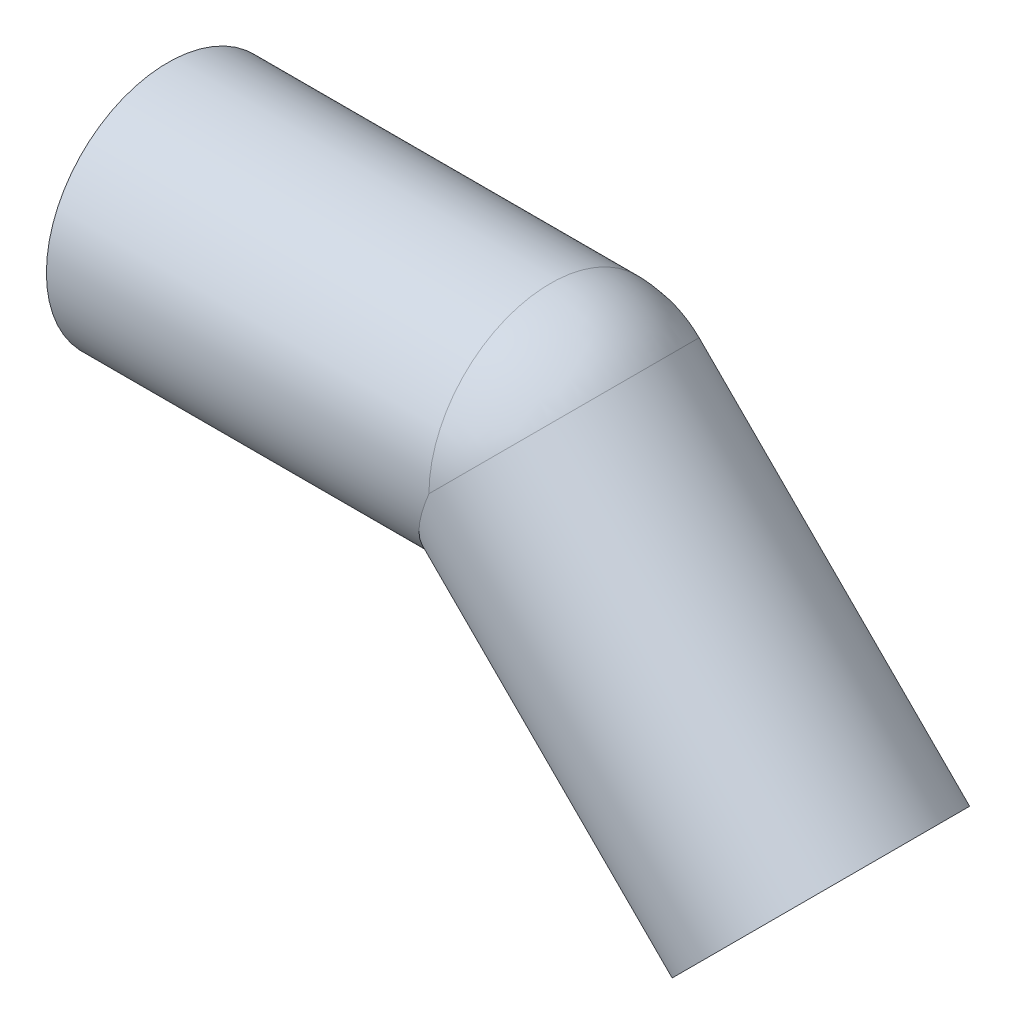
ISO-10303-21;
HEADER;
FILE_DESCRIPTION(('STEP AP214'),'2;1');
FILE_NAME('part.step','',(''),(''),'','','');
FILE_SCHEMA(('AUTOMOTIVE_DESIGN { 1 0 10303 214 1 1 1 1 }'));
ENDSEC;
DATA;
#1=APPLICATION_CONTEXT('core data for automotive mechanical design processes');
#2=APPLICATION_PROTOCOL_DEFINITION('international standard','automotive_design',2000,#1);
#3=PRODUCT_CONTEXT('',#1,'mechanical');
#4=PRODUCT('Part','Part','',(#3));
#5=PRODUCT_RELATED_PRODUCT_CATEGORY('part','',(#4));
#6=PRODUCT_DEFINITION_FORMATION('','',#4);
#7=PRODUCT_DEFINITION_CONTEXT('part definition',#1,'design');
#8=PRODUCT_DEFINITION('design','',#6,#7);
#9=PRODUCT_DEFINITION_SHAPE('','',#8);
#10=(LENGTH_UNIT() NAMED_UNIT(*) SI_UNIT(.MILLI.,.METRE.));
#11=(NAMED_UNIT(*) PLANE_ANGLE_UNIT() SI_UNIT($,.RADIAN.));
#12=(NAMED_UNIT(*) SI_UNIT($,.STERADIAN.) SOLID_ANGLE_UNIT());
#13=UNCERTAINTY_MEASURE_WITH_UNIT(LENGTH_MEASURE(1.E-05),#10,'distance_accuracy_value','');
#14=(GEOMETRIC_REPRESENTATION_CONTEXT(3) GLOBAL_UNCERTAINTY_ASSIGNED_CONTEXT((#13)) GLOBAL_UNIT_ASSIGNED_CONTEXT((#10,
#11,#12)) REPRESENTATION_CONTEXT('',''));
#15=CARTESIAN_POINT('',(0.,0.,0.));
#16=DIRECTION('',(0.,0.,1.));
#17=DIRECTION('',(1.,0.,0.));
#18=AXIS2_PLACEMENT_3D('',#15,#16,#17);
#19=CARTESIAN_POINT('',(107.547727214753,-44.5477272147515,0.));
#20=DIRECTION('',(-0.707106781186569,0.707106781186526,0.));
#21=DIRECTION('',(-0.707106781186526,-0.707106781186569,0.));
#22=AXIS2_PLACEMENT_3D('',#19,#20,#21);
#23=CYLINDRICAL_SURFACE('',#22,16.3);
#24=CARTESIAN_POINT('',(63.,0.,0.));
#25=DIRECTION('',(0.707106781186548,-0.707106781186547,0.));
#26=DIRECTION('',(0.,0.,-1.));
#27=AXIS2_PLACEMENT_3D('',#24,#25,#26);
#28=CIRCLE('',#27,16.3);
#29=CARTESIAN_POINT('',(74.5258405339315,11.52584053275,0.));
#30=VERTEX_POINT('',#29);
#31=CARTESIAN_POINT('',(62.9999999999988,4.62305732150405E-13,16.3));
#32=VERTEX_POINT('',#31);
#33=EDGE_CURVE('E53',#30,#32,#28,.T.);
#34=ORIENTED_EDGE('',*,*,#33,.F.);
#35=CARTESIAN_POINT('',(63.,0.,0.));
#36=DIRECTION('',(0.707106781077816,-0.707106781295279,0.));
#37=DIRECTION('',(0.,0.,-1.));
#38=AXIS2_PLACEMENT_3D('',#35,#36,#37);
#39=CIRCLE('',#38,16.3);
#40=CARTESIAN_POINT('',(62.9999999999988,4.89359454052071E-13,-16.3));
#41=VERTEX_POINT('',#40);
#42=EDGE_CURVE('E46',#41,#30,#39,.T.);
#43=ORIENTED_EDGE('',*,*,#42,.F.);
#44=CARTESIAN_POINT('',(62.9999999999986,0.,0.));
#45=DIRECTION('',(-0.923879532511293,0.382683432365076,0.));
#46=DIRECTION('',(-0.382683432365076,-0.923879532511293,0.));
#47=AXIS2_PLACEMENT_3D('',#44,#45,#46);
#48=ELLIPSE('',#47,17.6429928647659,16.3);
#49=EDGE_CURVE('E55',#32,#41,#48,.F.);
#50=ORIENTED_EDGE('',*,*,#49,.F.);
#51=EDGE_LOOP('',(#34,#43,#50));
#52=FACE_BOUND('',#51,.T.);
#53=CARTESIAN_POINT('',(107.547727214753,-44.5477272147522,0.));
#54=DIRECTION('',(-0.707106781186569,0.707106781186527,0.));
#55=DIRECTION('',(-0.707106781186527,-0.707106781186569,0.));
#56=AXIS2_PLACEMENT_3D('',#53,#54,#55);
#57=CIRCLE('',#56,16.3);
#58=CARTESIAN_POINT('',(96.0218866814131,-56.0735677480933,0.));
#59=VERTEX_POINT('',#58);
#60=EDGE_CURVE('E18',#59,#59,#57,.T.);
#61=ORIENTED_EDGE('',*,*,#60,.F.);
#62=EDGE_LOOP('',(#61));
#63=FACE_BOUND('',#62,.T.);
#64=ADVANCED_FACE('F15',(#52,#63),#23,.F.);
#65=CARTESIAN_POINT('',(63.,0.,0.));
#66=DIRECTION('',(0.,0.,1.));
#67=DIRECTION('',(-1.,0.,0.));
#68=AXIS2_PLACEMENT_3D('',#65,#66,#67);
#69=SPHERICAL_SURFACE('',#68,16.3);
#70=CARTESIAN_POINT('',(63.,0.,0.));
#71=DIRECTION('',(-1.,0.,0.));
#72=DIRECTION('',(0.,1.,0.));
#73=AXIS2_PLACEMENT_3D('',#70,#71,#72);
#74=CIRCLE('',#73,16.3);
#75=EDGE_CURVE('E51',#41,#32,#74,.F.);
#76=ORIENTED_EDGE('',*,*,#75,.F.);
#77=ORIENTED_EDGE('',*,*,#42,.T.);
#78=ORIENTED_EDGE('',*,*,#33,.T.);
#79=EDGE_LOOP('',(#76,#77,#78));
#80=FACE_BOUND('',#79,.T.);
#81=ADVANCED_FACE('F58',(#80),#69,.F.);
#82=CARTESIAN_POINT('',(121.689862838484,-30.4055915910214,20.2400021082666));
#83=DIRECTION('',(0.707106781186547,-0.707106781186547,0.));
#84=DIRECTION('',(-0.707106781186547,-0.707106781186547,0.));
#85=AXIS2_PLACEMENT_3D('',#82,#83,#84);
#86=PLANE('',#85);
#87=ORIENTED_EDGE('',*,*,#60,.T.);
#88=EDGE_LOOP('',(#87));
#89=FACE_BOUND('',#88,.T.);
#90=CARTESIAN_POINT('',(107.547727214753,-44.5477272147523,0.));
#91=DIRECTION('',(-0.707106781186563,0.707106781186532,0.));
#92=DIRECTION('',(-0.707106781186532,-0.707106781186563,0.));
#93=AXIS2_PLACEMENT_3D('',#90,#91,#92);
#94=CIRCLE('',#93,20.);
#95=CARTESIAN_POINT('',(93.4055915910227,-58.6898628384836,0.));
#96=VERTEX_POINT('',#95);
#97=EDGE_CURVE('E71',#96,#96,#94,.T.);
#98=ORIENTED_EDGE('',*,*,#97,.F.);
#99=EDGE_LOOP('',(#98));
#100=FACE_BOUND('',#99,.T.);
#101=ADVANCED_FACE('F80',(#89,#100),#86,.T.);
#102=CARTESIAN_POINT('',(63.,0.,0.));
#103=DIRECTION('',(-1.,0.,0.));
#104=DIRECTION('',(0.,0.,1.));
#105=AXIS2_PLACEMENT_3D('',#102,#103,#104);
#106=CYLINDRICAL_SURFACE('',#105,16.3);
#107=CARTESIAN_POINT('',(0.,0.,0.));
#108=DIRECTION('',(-1.,0.,0.));
#109=DIRECTION('',(0.,0.,1.));
#110=AXIS2_PLACEMENT_3D('',#107,#108,#109);
#111=CIRCLE('',#110,16.3);
#112=CARTESIAN_POINT('',(0.,0.,16.3));
#113=VERTEX_POINT('',#112);
#114=EDGE_CURVE('E68',#113,#113,#111,.F.);
#115=ORIENTED_EDGE('',*,*,#114,.F.);
#116=EDGE_LOOP('',(#115));
#117=FACE_BOUND('',#116,.T.);
#118=ORIENTED_EDGE('',*,*,#49,.T.);
#119=ORIENTED_EDGE('',*,*,#75,.T.);
#120=EDGE_LOOP('',(#118,#119));
#121=FACE_BOUND('',#120,.T.);
#122=ADVANCED_FACE('F83',(#117,#121),#106,.F.);
#123=CARTESIAN_POINT('',(63.,0.,0.));
#124=DIRECTION('',(0.,0.,1.));
#125=DIRECTION('',(1.,0.,0.));
#126=AXIS2_PLACEMENT_3D('',#123,#124,#125);
#127=SPHERICAL_SURFACE('',#126,20.);
#128=CARTESIAN_POINT('',(63.,0.,0.));
#129=DIRECTION('',(-1.,0.,0.));
#130=DIRECTION('',(0.,1.,0.));
#131=AXIS2_PLACEMENT_3D('',#128,#129,#130);
#132=CIRCLE('',#131,20.);
#133=CARTESIAN_POINT('',(62.9999999999992,3.63431183095844E-13,20.));
#134=VERTEX_POINT('',#133);
#135=CARTESIAN_POINT('',(62.9999999999992,3.75736161615242E-13,-20.0000000000002));
#136=VERTEX_POINT('',#135);
#137=EDGE_CURVE('E67',#134,#136,#132,.T.);
#138=ORIENTED_EDGE('',*,*,#137,.F.);
#139=CARTESIAN_POINT('',(63.,0.,0.));
#140=DIRECTION('',(-0.707106781141104,0.707106781231991,0.));
#141=DIRECTION('',(0.,0.,1.));
#142=AXIS2_PLACEMENT_3D('',#139,#140,#141);
#143=CIRCLE('',#142,20.);
#144=CARTESIAN_POINT('',(77.1421356241852,14.1421356232767,0.));
#145=VERTEX_POINT('',#144);
#146=EDGE_CURVE('E73',#134,#145,#143,.T.);
#147=ORIENTED_EDGE('',*,*,#146,.T.);
#148=CARTESIAN_POINT('',(62.9999999999995,-4.96130914129367E-13,0.));
#149=DIRECTION('',(-0.707106781186563,0.707106781186532,0.));
#150=DIRECTION('',(0.707106781186532,0.707106781186563,0.));
#151=AXIS2_PLACEMENT_3D('',#148,#149,#150);
#152=CIRCLE('',#151,20.0000000000007);
#153=EDGE_CURVE('E33',#136,#145,#152,.F.);
#154=ORIENTED_EDGE('',*,*,#153,.F.);
#155=EDGE_LOOP('',(#138,#147,#154));
#156=FACE_BOUND('',#155,.T.);
#157=ADVANCED_FACE('F87',(#156),#127,.T.);
#158=CARTESIAN_POINT('',(62.9999999999995,-4.97865637605344E-13,0.));
#159=DIRECTION('',(-0.707106781186563,0.707106781186532,0.));
#160=DIRECTION('',(-0.707106781186532,-0.707106781186563,0.));
#161=AXIS2_PLACEMENT_3D('',#158,#159,#160);
#162=CYLINDRICAL_SURFACE('',#161,20.);
#163=ORIENTED_EDGE('',*,*,#97,.T.);
#164=EDGE_LOOP('',(#163));
#165=FACE_BOUND('',#164,.T.);
#166=CARTESIAN_POINT('',(62.999999999999,0.,0.));
#167=DIRECTION('',(-0.923879532511291,0.38268343236508,0.));
#168=DIRECTION('',(0.382683432365079,0.923879532511291,0.));
#169=AXIS2_PLACEMENT_3D('',#166,#167,#168);
#170=ELLIPSE('',#169,21.6478440058478,20.);
#171=EDGE_CURVE('E24',#136,#134,#170,.T.);
#172=ORIENTED_EDGE('',*,*,#171,.F.);
#173=ORIENTED_EDGE('',*,*,#153,.T.);
#174=ORIENTED_EDGE('',*,*,#146,.F.);
#175=EDGE_LOOP('',(#172,#173,#174));
#176=FACE_BOUND('',#175,.T.);
#177=ADVANCED_FACE('F91',(#165,#176),#162,.T.);
#178=CARTESIAN_POINT('',(0.,-20.,20.2400021083327));
#179=DIRECTION('',(-1.,0.,0.));
#180=DIRECTION('',(0.,1.,0.));
#181=AXIS2_PLACEMENT_3D('',#178,#179,#180);
#182=PLANE('',#181);
#183=ORIENTED_EDGE('',*,*,#114,.T.);
#184=EDGE_LOOP('',(#183));
#185=FACE_BOUND('',#184,.T.);
#186=CARTESIAN_POINT('',(0.,0.,0.));
#187=DIRECTION('',(-1.,0.,0.));
#188=DIRECTION('',(0.,0.,1.));
#189=AXIS2_PLACEMENT_3D('',#186,#187,#188);
#190=CIRCLE('',#189,20.);
#191=CARTESIAN_POINT('',(0.,0.,20.));
#192=VERTEX_POINT('',#191);
#193=EDGE_CURVE('E9',#192,#192,#190,.F.);
#194=ORIENTED_EDGE('',*,*,#193,.F.);
#195=EDGE_LOOP('',(#194));
#196=FACE_BOUND('',#195,.T.);
#197=ADVANCED_FACE('F105',(#185,#196),#182,.T.);
#198=CARTESIAN_POINT('',(0.,0.,0.));
#199=DIRECTION('',(-1.,0.,0.));
#200=DIRECTION('',(0.,0.,1.));
#201=AXIS2_PLACEMENT_3D('',#198,#199,#200);
#202=CYLINDRICAL_SURFACE('',#201,20.);
#203=ORIENTED_EDGE('',*,*,#171,.T.);
#204=ORIENTED_EDGE('',*,*,#137,.T.);
#205=EDGE_LOOP('',(#203,#204));
#206=FACE_BOUND('',#205,.T.);
#207=ORIENTED_EDGE('',*,*,#193,.T.);
#208=EDGE_LOOP('',(#207));
#209=FACE_BOUND('',#208,.T.);
#210=ADVANCED_FACE('F102',(#206,#209),#202,.T.);
#211=CLOSED_SHELL('',(#64,#81,#101,#122,#157,#177,#197,#210));
#212=MANIFOLD_SOLID_BREP('B1',#211);
#213=ADVANCED_BREP_SHAPE_REPRESENTATION('',(#18,#212),#14);
#214=SHAPE_DEFINITION_REPRESENTATION(#9,#213);
ENDSEC;
END-ISO-10303-21;
